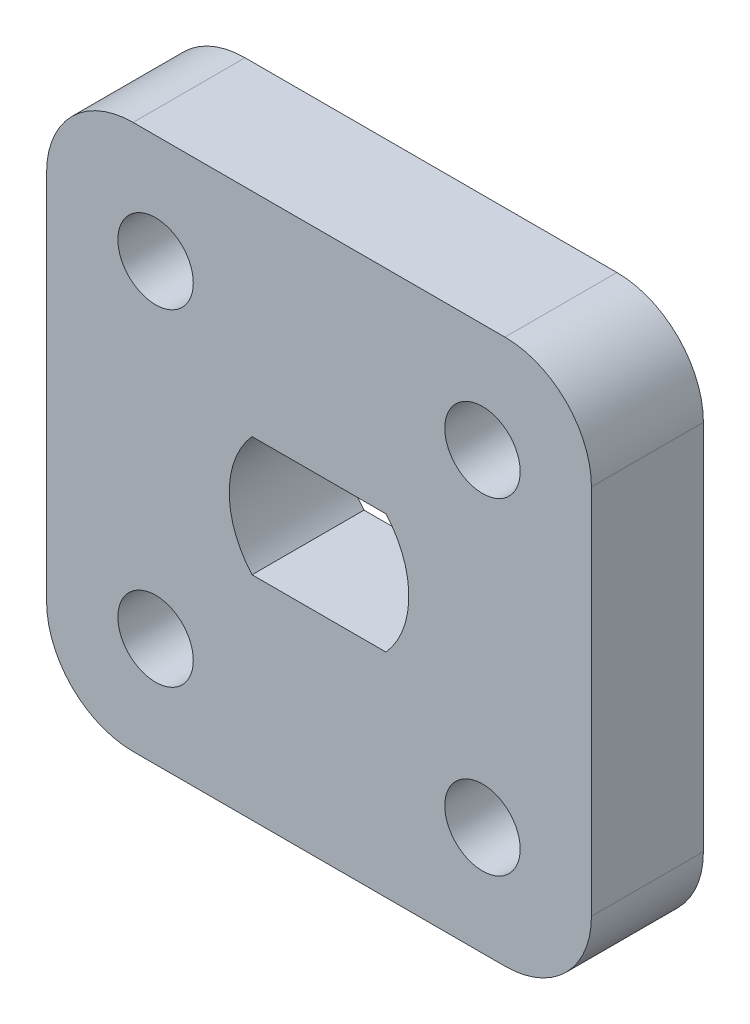
ISO-10303-21;
HEADER;
FILE_DESCRIPTION(('STEP AP214'),'2;1');
FILE_NAME('part.step','',(''),(''),'','','');
FILE_SCHEMA(('AUTOMOTIVE_DESIGN { 1 0 10303 214 1 1 1 1 }'));
ENDSEC;
DATA;
#1=APPLICATION_CONTEXT('core data for automotive mechanical design processes');
#2=APPLICATION_PROTOCOL_DEFINITION('international standard','automotive_design',2000,#1);
#3=PRODUCT_CONTEXT('',#1,'mechanical');
#4=PRODUCT('Part','Part','',(#3));
#5=PRODUCT_RELATED_PRODUCT_CATEGORY('part','',(#4));
#6=PRODUCT_DEFINITION_FORMATION('','',#4);
#7=PRODUCT_DEFINITION_CONTEXT('part definition',#1,'design');
#8=PRODUCT_DEFINITION('design','',#6,#7);
#9=PRODUCT_DEFINITION_SHAPE('','',#8);
#10=(LENGTH_UNIT() NAMED_UNIT(*) SI_UNIT(.MILLI.,.METRE.));
#11=(NAMED_UNIT(*) PLANE_ANGLE_UNIT() SI_UNIT($,.RADIAN.));
#12=(NAMED_UNIT(*) SI_UNIT($,.STERADIAN.) SOLID_ANGLE_UNIT());
#13=UNCERTAINTY_MEASURE_WITH_UNIT(LENGTH_MEASURE(1.E-05),#10,'distance_accuracy_value','');
#14=(GEOMETRIC_REPRESENTATION_CONTEXT(3) GLOBAL_UNCERTAINTY_ASSIGNED_CONTEXT((#13)) GLOBAL_UNIT_ASSIGNED_CONTEXT((#10,
#11,#12)) REPRESENTATION_CONTEXT('',''));
#15=CARTESIAN_POINT('',(0.,0.,0.));
#16=DIRECTION('',(0.,0.,1.));
#17=DIRECTION('',(1.,0.,0.));
#18=AXIS2_PLACEMENT_3D('',#15,#16,#17);
#19=CARTESIAN_POINT('',(0.,0.,4.11));
#20=DIRECTION('',(0.,0.,1.));
#21=DIRECTION('',(1.,0.,0.));
#22=AXIS2_PLACEMENT_3D('',#19,#20,#21);
#23=PLANE('',#22);
#24=CARTESIAN_POINT('',(0.,0.,4.11));
#25=DIRECTION('',(0.,0.,-1.));
#26=DIRECTION('',(-1.,0.,0.));
#27=AXIS2_PLACEMENT_3D('',#24,#25,#26);
#28=CIRCLE('',#27,3.2968);
#29=CARTESIAN_POINT('',(-2.45824327518657,-2.1968,4.11));
#30=VERTEX_POINT('',#29);
#31=CARTESIAN_POINT('',(-2.45824327518657,2.1968,4.11));
#32=VERTEX_POINT('',#31);
#33=EDGE_CURVE('E127',#30,#32,#28,.T.);
#34=ORIENTED_EDGE('',*,*,#33,.T.);
#35=DIRECTION('',(1.,0.,0.));
#36=VECTOR('',#35,1.);
#37=CARTESIAN_POINT('',(-2.45824327518657,2.1968,4.11));
#38=LINE('',#37,#36);
#39=CARTESIAN_POINT('',(2.45824327518657,2.1968,4.11));
#40=VERTEX_POINT('',#39);
#41=EDGE_CURVE('E139',#32,#40,#38,.T.);
#42=ORIENTED_EDGE('',*,*,#41,.T.);
#43=CARTESIAN_POINT('',(0.,0.,4.11));
#44=DIRECTION('',(0.,0.,-1.));
#45=DIRECTION('',(-1.,0.,0.));
#46=AXIS2_PLACEMENT_3D('',#43,#44,#45);
#47=CIRCLE('',#46,3.2968);
#48=CARTESIAN_POINT('',(2.45824327518657,-2.1968,4.11));
#49=VERTEX_POINT('',#48);
#50=EDGE_CURVE('E143',#40,#49,#47,.T.);
#51=ORIENTED_EDGE('',*,*,#50,.T.);
#52=DIRECTION('',(-1.,0.,0.));
#53=VECTOR('',#52,1.);
#54=CARTESIAN_POINT('',(-2.45824327518657,-2.1968,4.11));
#55=LINE('',#54,#53);
#56=EDGE_CURVE('E135',#49,#30,#55,.T.);
#57=ORIENTED_EDGE('',*,*,#56,.T.);
#58=EDGE_LOOP('',(#34,#42,#51,#57));
#59=FACE_BOUND('',#58,.T.);
#60=CARTESIAN_POINT('',(6.,-6.,4.11));
#61=DIRECTION('',(0.,0.,1.));
#62=DIRECTION('',(1.,0.,0.));
#63=AXIS2_PLACEMENT_3D('',#60,#61,#62);
#64=CIRCLE('',#63,1.3843);
#65=CARTESIAN_POINT('',(7.3843,-6.,4.11));
#66=VERTEX_POINT('',#65);
#67=EDGE_CURVE('E172',#66,#66,#64,.T.);
#68=ORIENTED_EDGE('',*,*,#67,.F.);
#69=EDGE_LOOP('',(#68));
#70=FACE_BOUND('',#69,.T.);
#71=CARTESIAN_POINT('',(-6.,5.99999999999999,4.11));
#72=DIRECTION('',(0.,0.,1.));
#73=DIRECTION('',(1.,0.,0.));
#74=AXIS2_PLACEMENT_3D('',#71,#72,#73);
#75=CIRCLE('',#74,1.3843);
#76=CARTESIAN_POINT('',(-4.61569999999999,5.99999999999999,4.11));
#77=VERTEX_POINT('',#76);
#78=EDGE_CURVE('E184',#77,#77,#75,.T.);
#79=ORIENTED_EDGE('',*,*,#78,.F.);
#80=EDGE_LOOP('',(#79));
#81=FACE_BOUND('',#80,.T.);
#82=DIRECTION('',(0.,-1.,0.));
#83=VECTOR('',#82,1.);
#84=CARTESIAN_POINT('',(-10.,-10.,4.11));
#85=LINE('',#84,#83);
#86=CARTESIAN_POINT('',(-10.,6.825,4.11));
#87=VERTEX_POINT('',#86);
#88=CARTESIAN_POINT('',(-10.,-6.825,4.11));
#89=VERTEX_POINT('',#88);
#90=EDGE_CURVE('E190',#87,#89,#85,.T.);
#91=ORIENTED_EDGE('',*,*,#90,.T.);
#92=CARTESIAN_POINT('',(-6.825,-6.825,4.11));
#93=DIRECTION('',(0.,0.,1.));
#94=DIRECTION('',(1.,0.,0.));
#95=AXIS2_PLACEMENT_3D('',#92,#93,#94);
#96=CIRCLE('',#95,3.175);
#97=CARTESIAN_POINT('',(-6.825,-10.,4.11));
#98=VERTEX_POINT('',#97);
#99=EDGE_CURVE('E233',#89,#98,#96,.T.);
#100=ORIENTED_EDGE('',*,*,#99,.T.);
#101=DIRECTION('',(1.,0.,0.));
#102=VECTOR('',#101,1.);
#103=CARTESIAN_POINT('',(10.,-10.,4.11));
#104=LINE('',#103,#102);
#105=CARTESIAN_POINT('',(6.825,-10.,4.11));
#106=VERTEX_POINT('',#105);
#107=EDGE_CURVE('E193',#98,#106,#104,.T.);
#108=ORIENTED_EDGE('',*,*,#107,.T.);
#109=CARTESIAN_POINT('',(6.825,-6.825,4.11));
#110=DIRECTION('',(0.,0.,1.));
#111=DIRECTION('',(1.,0.,0.));
#112=AXIS2_PLACEMENT_3D('',#109,#110,#111);
#113=CIRCLE('',#112,3.175);
#114=CARTESIAN_POINT('',(10.,-6.825,4.11));
#115=VERTEX_POINT('',#114);
#116=EDGE_CURVE('E231',#106,#115,#113,.T.);
#117=ORIENTED_EDGE('',*,*,#116,.T.);
#118=DIRECTION('',(0.,1.,0.));
#119=VECTOR('',#118,1.);
#120=CARTESIAN_POINT('',(10.,-10.,4.11));
#121=LINE('',#120,#119);
#122=CARTESIAN_POINT('',(10.,6.825,4.11));
#123=VERTEX_POINT('',#122);
#124=EDGE_CURVE('E197',#115,#123,#121,.T.);
#125=ORIENTED_EDGE('',*,*,#124,.T.);
#126=CARTESIAN_POINT('',(6.825,6.825,4.11));
#127=DIRECTION('',(0.,0.,1.));
#128=DIRECTION('',(1.,0.,0.));
#129=AXIS2_PLACEMENT_3D('',#126,#127,#128);
#130=CIRCLE('',#129,3.175);
#131=CARTESIAN_POINT('',(6.825,10.,4.11));
#132=VERTEX_POINT('',#131);
#133=EDGE_CURVE('E54',#123,#132,#130,.T.);
#134=ORIENTED_EDGE('',*,*,#133,.T.);
#135=DIRECTION('',(-1.,0.,0.));
#136=VECTOR('',#135,1.);
#137=CARTESIAN_POINT('',(10.,10.,4.11));
#138=LINE('',#137,#136);
#139=CARTESIAN_POINT('',(-6.825,10.,4.11));
#140=VERTEX_POINT('',#139);
#141=EDGE_CURVE('E199',#132,#140,#138,.T.);
#142=ORIENTED_EDGE('',*,*,#141,.T.);
#143=CARTESIAN_POINT('',(-6.825,6.825,4.11));
#144=DIRECTION('',(0.,0.,1.));
#145=DIRECTION('',(1.,0.,0.));
#146=AXIS2_PLACEMENT_3D('',#143,#144,#145);
#147=CIRCLE('',#146,3.175);
#148=EDGE_CURVE('E228',#140,#87,#147,.T.);
#149=ORIENTED_EDGE('',*,*,#148,.T.);
#150=EDGE_LOOP('',(#91,#100,#108,#117,#125,#134,#142,#149));
#151=FACE_BOUND('',#150,.T.);
#152=CARTESIAN_POINT('',(6.,5.99999999999999,4.11));
#153=DIRECTION('',(0.,0.,1.));
#154=DIRECTION('',(1.,0.,0.));
#155=AXIS2_PLACEMENT_3D('',#152,#153,#154);
#156=CIRCLE('',#155,1.3843);
#157=CARTESIAN_POINT('',(7.3843,5.99999999999999,4.11));
#158=VERTEX_POINT('',#157);
#159=EDGE_CURVE('E178',#158,#158,#156,.T.);
#160=ORIENTED_EDGE('',*,*,#159,.F.);
#161=EDGE_LOOP('',(#160));
#162=FACE_BOUND('',#161,.T.);
#163=CARTESIAN_POINT('',(-6.,-6.,4.11));
#164=DIRECTION('',(0.,0.,1.));
#165=DIRECTION('',(1.,0.,0.));
#166=AXIS2_PLACEMENT_3D('',#163,#164,#165);
#167=CIRCLE('',#166,1.3843);
#168=CARTESIAN_POINT('',(-4.61569999999999,-6.,4.11));
#169=VERTEX_POINT('',#168);
#170=EDGE_CURVE('E166',#169,#169,#167,.T.);
#171=ORIENTED_EDGE('',*,*,#170,.F.);
#172=EDGE_LOOP('',(#171));
#173=FACE_BOUND('',#172,.T.);
#174=ADVANCED_FACE('F33',(#59,#70,#81,#151,#162,#173),#23,.T.);
#175=CARTESIAN_POINT('',(0.,0.,0.));
#176=DIRECTION('',(0.,0.,1.));
#177=DIRECTION('',(1.,0.,0.));
#178=AXIS2_PLACEMENT_3D('',#175,#176,#177);
#179=PLANE('',#178);
#180=DIRECTION('',(1.,0.,0.));
#181=VECTOR('',#180,1.);
#182=CARTESIAN_POINT('',(-2.45824327518657,2.1968,0.));
#183=LINE('',#182,#181);
#184=CARTESIAN_POINT('',(-2.45824327518657,2.1968,0.));
#185=VERTEX_POINT('',#184);
#186=CARTESIAN_POINT('',(2.45824327518657,2.1968,0.));
#187=VERTEX_POINT('',#186);
#188=EDGE_CURVE('E156',#185,#187,#183,.T.);
#189=ORIENTED_EDGE('',*,*,#188,.F.);
#190=CARTESIAN_POINT('',(0.,0.,0.));
#191=DIRECTION('',(0.,0.,-1.));
#192=DIRECTION('',(-1.,0.,0.));
#193=AXIS2_PLACEMENT_3D('',#190,#191,#192);
#194=CIRCLE('',#193,3.2968);
#195=CARTESIAN_POINT('',(-2.45824327518657,-2.1968,0.));
#196=VERTEX_POINT('',#195);
#197=EDGE_CURVE('E130',#196,#185,#194,.T.);
#198=ORIENTED_EDGE('',*,*,#197,.F.);
#199=DIRECTION('',(-1.,0.,0.));
#200=VECTOR('',#199,1.);
#201=CARTESIAN_POINT('',(-2.45824327518657,-2.1968,0.));
#202=LINE('',#201,#200);
#203=CARTESIAN_POINT('',(2.45824327518657,-2.1968,0.));
#204=VERTEX_POINT('',#203);
#205=EDGE_CURVE('E147',#204,#196,#202,.T.);
#206=ORIENTED_EDGE('',*,*,#205,.F.);
#207=CARTESIAN_POINT('',(0.,0.,0.));
#208=DIRECTION('',(0.,0.,-1.));
#209=DIRECTION('',(-1.,0.,0.));
#210=AXIS2_PLACEMENT_3D('',#207,#208,#209);
#211=CIRCLE('',#210,3.2968);
#212=EDGE_CURVE('E150',#187,#204,#211,.T.);
#213=ORIENTED_EDGE('',*,*,#212,.F.);
#214=EDGE_LOOP('',(#189,#198,#206,#213));
#215=FACE_BOUND('',#214,.T.);
#216=DIRECTION('',(1.,0.,0.));
#217=VECTOR('',#216,1.);
#218=CARTESIAN_POINT('',(10.,-10.,0.));
#219=LINE('',#218,#217);
#220=CARTESIAN_POINT('',(-6.825,-10.,0.));
#221=VERTEX_POINT('',#220);
#222=CARTESIAN_POINT('',(6.825,-10.,0.));
#223=VERTEX_POINT('',#222);
#224=EDGE_CURVE('E204',#221,#223,#219,.T.);
#225=ORIENTED_EDGE('',*,*,#224,.F.);
#226=CARTESIAN_POINT('',(-6.825,-6.825,0.));
#227=DIRECTION('',(0.,0.,1.));
#228=DIRECTION('',(1.,0.,0.));
#229=AXIS2_PLACEMENT_3D('',#226,#227,#228);
#230=CIRCLE('',#229,3.175);
#231=CARTESIAN_POINT('',(-10.,-6.825,0.));
#232=VERTEX_POINT('',#231);
#233=EDGE_CURVE('E221',#221,#232,#230,.F.);
#234=ORIENTED_EDGE('',*,*,#233,.T.);
#235=DIRECTION('',(0.,-1.,0.));
#236=VECTOR('',#235,1.);
#237=CARTESIAN_POINT('',(-10.,-10.,0.));
#238=LINE('',#237,#236);
#239=CARTESIAN_POINT('',(-10.,6.825,0.));
#240=VERTEX_POINT('',#239);
#241=EDGE_CURVE('E187',#240,#232,#238,.T.);
#242=ORIENTED_EDGE('',*,*,#241,.F.);
#243=CARTESIAN_POINT('',(-6.825,6.825,0.));
#244=DIRECTION('',(0.,0.,1.));
#245=DIRECTION('',(1.,0.,0.));
#246=AXIS2_PLACEMENT_3D('',#243,#244,#245);
#247=CIRCLE('',#246,3.175);
#248=CARTESIAN_POINT('',(-6.825,10.,0.));
#249=VERTEX_POINT('',#248);
#250=EDGE_CURVE('E215',#240,#249,#247,.F.);
#251=ORIENTED_EDGE('',*,*,#250,.T.);
#252=DIRECTION('',(-1.,0.,0.));
#253=VECTOR('',#252,1.);
#254=CARTESIAN_POINT('',(10.,10.,0.));
#255=LINE('',#254,#253);
#256=CARTESIAN_POINT('',(6.825,10.,0.));
#257=VERTEX_POINT('',#256);
#258=EDGE_CURVE('E194',#257,#249,#255,.T.);
#259=ORIENTED_EDGE('',*,*,#258,.F.);
#260=CARTESIAN_POINT('',(6.825,6.825,0.));
#261=DIRECTION('',(0.,0.,1.));
#262=DIRECTION('',(1.,0.,0.));
#263=AXIS2_PLACEMENT_3D('',#260,#261,#262);
#264=CIRCLE('',#263,3.175);
#265=CARTESIAN_POINT('',(10.,6.825,0.));
#266=VERTEX_POINT('',#265);
#267=EDGE_CURVE('E217',#257,#266,#264,.F.);
#268=ORIENTED_EDGE('',*,*,#267,.T.);
#269=DIRECTION('',(0.,1.,0.));
#270=VECTOR('',#269,1.);
#271=CARTESIAN_POINT('',(10.,-10.,0.));
#272=LINE('',#271,#270);
#273=CARTESIAN_POINT('',(10.,-6.825,0.));
#274=VERTEX_POINT('',#273);
#275=EDGE_CURVE('E207',#274,#266,#272,.T.);
#276=ORIENTED_EDGE('',*,*,#275,.F.);
#277=CARTESIAN_POINT('',(6.825,-6.825,0.));
#278=DIRECTION('',(0.,0.,1.));
#279=DIRECTION('',(1.,0.,0.));
#280=AXIS2_PLACEMENT_3D('',#277,#278,#279);
#281=CIRCLE('',#280,3.175);
#282=EDGE_CURVE('E219',#274,#223,#281,.F.);
#283=ORIENTED_EDGE('',*,*,#282,.T.);
#284=EDGE_LOOP('',(#225,#234,#242,#251,#259,#268,#276,#283));
#285=FACE_BOUND('',#284,.T.);
#286=CARTESIAN_POINT('',(-6.,5.99999999999999,0.));
#287=DIRECTION('',(0.,0.,1.));
#288=DIRECTION('',(1.,0.,0.));
#289=AXIS2_PLACEMENT_3D('',#286,#287,#288);
#290=CIRCLE('',#289,1.3843);
#291=CARTESIAN_POINT('',(-4.61569999999999,5.99999999999999,0.));
#292=VERTEX_POINT('',#291);
#293=EDGE_CURVE('E181',#292,#292,#290,.T.);
#294=ORIENTED_EDGE('',*,*,#293,.T.);
#295=EDGE_LOOP('',(#294));
#296=FACE_BOUND('',#295,.T.);
#297=CARTESIAN_POINT('',(6.,5.99999999999999,0.));
#298=DIRECTION('',(0.,0.,1.));
#299=DIRECTION('',(1.,0.,0.));
#300=AXIS2_PLACEMENT_3D('',#297,#298,#299);
#301=CIRCLE('',#300,1.3843);
#302=CARTESIAN_POINT('',(7.3843,5.99999999999999,0.));
#303=VERTEX_POINT('',#302);
#304=EDGE_CURVE('E175',#303,#303,#301,.T.);
#305=ORIENTED_EDGE('',*,*,#304,.T.);
#306=EDGE_LOOP('',(#305));
#307=FACE_BOUND('',#306,.T.);
#308=CARTESIAN_POINT('',(6.,-6.,0.));
#309=DIRECTION('',(0.,0.,1.));
#310=DIRECTION('',(1.,0.,0.));
#311=AXIS2_PLACEMENT_3D('',#308,#309,#310);
#312=CIRCLE('',#311,1.3843);
#313=CARTESIAN_POINT('',(7.3843,-6.,0.));
#314=VERTEX_POINT('',#313);
#315=EDGE_CURVE('E169',#314,#314,#312,.T.);
#316=ORIENTED_EDGE('',*,*,#315,.T.);
#317=EDGE_LOOP('',(#316));
#318=FACE_BOUND('',#317,.T.);
#319=CARTESIAN_POINT('',(-6.,-6.,0.));
#320=DIRECTION('',(0.,0.,1.));
#321=DIRECTION('',(1.,0.,0.));
#322=AXIS2_PLACEMENT_3D('',#319,#320,#321);
#323=CIRCLE('',#322,1.3843);
#324=CARTESIAN_POINT('',(-4.61569999999999,-6.,0.));
#325=VERTEX_POINT('',#324);
#326=EDGE_CURVE('E162',#325,#325,#323,.T.);
#327=ORIENTED_EDGE('',*,*,#326,.T.);
#328=EDGE_LOOP('',(#327));
#329=FACE_BOUND('',#328,.T.);
#330=ADVANCED_FACE('F249',(#215,#285,#296,#307,#318,#329),#179,.F.);
#331=CARTESIAN_POINT('',(-10.,-10.,4.11));
#332=DIRECTION('',(1.,0.,0.));
#333=DIRECTION('',(0.,1.,0.));
#334=AXIS2_PLACEMENT_3D('',#331,#332,#333);
#335=PLANE('',#334);
#336=ORIENTED_EDGE('',*,*,#241,.T.);
#337=DIRECTION('',(0.,0.,-1.));
#338=VECTOR('',#337,1.);
#339=CARTESIAN_POINT('',(-10.,-6.825,4.11));
#340=LINE('',#339,#338);
#341=EDGE_CURVE('E226',#232,#89,#340,.F.);
#342=ORIENTED_EDGE('',*,*,#341,.T.);
#343=ORIENTED_EDGE('',*,*,#90,.F.);
#344=DIRECTION('',(0.,0.,-1.));
#345=VECTOR('',#344,1.);
#346=CARTESIAN_POINT('',(-10.,6.825,4.11));
#347=LINE('',#346,#345);
#348=EDGE_CURVE('E223',#87,#240,#347,.T.);
#349=ORIENTED_EDGE('',*,*,#348,.T.);
#350=EDGE_LOOP('',(#336,#342,#343,#349));
#351=FACE_BOUND('',#350,.T.);
#352=ADVANCED_FACE('F263',(#351),#335,.F.);
#353=CARTESIAN_POINT('',(10.,-10.,4.11));
#354=DIRECTION('',(0.,1.,0.));
#355=DIRECTION('',(-1.,0.,0.));
#356=AXIS2_PLACEMENT_3D('',#353,#354,#355);
#357=PLANE('',#356);
#358=ORIENTED_EDGE('',*,*,#107,.F.);
#359=DIRECTION('',(0.,0.,-1.));
#360=VECTOR('',#359,1.);
#361=CARTESIAN_POINT('',(-6.825,-10.,4.11));
#362=LINE('',#361,#360);
#363=EDGE_CURVE('E212',#98,#221,#362,.T.);
#364=ORIENTED_EDGE('',*,*,#363,.T.);
#365=ORIENTED_EDGE('',*,*,#224,.T.);
#366=DIRECTION('',(0.,0.,-1.));
#367=VECTOR('',#366,1.);
#368=CARTESIAN_POINT('',(6.825,-10.,4.11));
#369=LINE('',#368,#367);
#370=EDGE_CURVE('E201',#223,#106,#369,.F.);
#371=ORIENTED_EDGE('',*,*,#370,.T.);
#372=EDGE_LOOP('',(#358,#364,#365,#371));
#373=FACE_BOUND('',#372,.T.);
#374=ADVANCED_FACE('F271',(#373),#357,.F.);
#375=CARTESIAN_POINT('',(10.,-10.,4.11));
#376=DIRECTION('',(-1.,0.,0.));
#377=DIRECTION('',(0.,-1.,0.));
#378=AXIS2_PLACEMENT_3D('',#375,#376,#377);
#379=PLANE('',#378);
#380=ORIENTED_EDGE('',*,*,#124,.F.);
#381=DIRECTION('',(0.,0.,-1.));
#382=VECTOR('',#381,1.);
#383=CARTESIAN_POINT('',(10.,-6.825,4.11));
#384=LINE('',#383,#382);
#385=EDGE_CURVE('E237',#115,#274,#384,.T.);
#386=ORIENTED_EDGE('',*,*,#385,.T.);
#387=ORIENTED_EDGE('',*,*,#275,.T.);
#388=DIRECTION('',(0.,0.,-1.));
#389=VECTOR('',#388,1.);
#390=CARTESIAN_POINT('',(10.,6.825,4.11));
#391=LINE('',#390,#389);
#392=EDGE_CURVE('E235',#266,#123,#391,.F.);
#393=ORIENTED_EDGE('',*,*,#392,.T.);
#394=EDGE_LOOP('',(#380,#386,#387,#393));
#395=FACE_BOUND('',#394,.T.);
#396=ADVANCED_FACE('F243',(#395),#379,.F.);
#397=CARTESIAN_POINT('',(10.,10.,4.11));
#398=DIRECTION('',(0.,-1.,0.));
#399=DIRECTION('',(1.,0.,0.));
#400=AXIS2_PLACEMENT_3D('',#397,#398,#399);
#401=PLANE('',#400);
#402=ORIENTED_EDGE('',*,*,#141,.F.);
#403=DIRECTION('',(0.,0.,-1.));
#404=VECTOR('',#403,1.);
#405=CARTESIAN_POINT('',(6.825,10.,4.11));
#406=LINE('',#405,#404);
#407=EDGE_CURVE('E11',#132,#257,#406,.T.);
#408=ORIENTED_EDGE('',*,*,#407,.T.);
#409=ORIENTED_EDGE('',*,*,#258,.T.);
#410=DIRECTION('',(0.,0.,-1.));
#411=VECTOR('',#410,1.);
#412=CARTESIAN_POINT('',(-6.825,10.,4.11));
#413=LINE('',#412,#411);
#414=EDGE_CURVE('E41',#249,#140,#413,.F.);
#415=ORIENTED_EDGE('',*,*,#414,.T.);
#416=EDGE_LOOP('',(#402,#408,#409,#415));
#417=FACE_BOUND('',#416,.T.);
#418=ADVANCED_FACE('F255',(#417),#401,.F.);
#419=CARTESIAN_POINT('',(-6.,5.99999999999999,4.11));
#420=DIRECTION('',(0.,0.,-1.));
#421=DIRECTION('',(-1.,0.,0.));
#422=AXIS2_PLACEMENT_3D('',#419,#420,#421);
#423=CYLINDRICAL_SURFACE('',#422,1.3843);
#424=ORIENTED_EDGE('',*,*,#78,.T.);
#425=EDGE_LOOP('',(#424));
#426=FACE_BOUND('',#425,.T.);
#427=ORIENTED_EDGE('',*,*,#293,.F.);
#428=EDGE_LOOP('',(#427));
#429=FACE_BOUND('',#428,.T.);
#430=ADVANCED_FACE('F289',(#426,#429),#423,.F.);
#431=CARTESIAN_POINT('',(6.,5.99999999999999,4.11));
#432=DIRECTION('',(0.,0.,-1.));
#433=DIRECTION('',(-1.,0.,0.));
#434=AXIS2_PLACEMENT_3D('',#431,#432,#433);
#435=CYLINDRICAL_SURFACE('',#434,1.3843);
#436=ORIENTED_EDGE('',*,*,#159,.T.);
#437=EDGE_LOOP('',(#436));
#438=FACE_BOUND('',#437,.T.);
#439=ORIENTED_EDGE('',*,*,#304,.F.);
#440=EDGE_LOOP('',(#439));
#441=FACE_BOUND('',#440,.T.);
#442=ADVANCED_FACE('F322',(#438,#441),#435,.F.);
#443=CARTESIAN_POINT('',(6.,-6.,4.11));
#444=DIRECTION('',(0.,0.,-1.));
#445=DIRECTION('',(-1.,0.,0.));
#446=AXIS2_PLACEMENT_3D('',#443,#444,#445);
#447=CYLINDRICAL_SURFACE('',#446,1.3843);
#448=ORIENTED_EDGE('',*,*,#67,.T.);
#449=EDGE_LOOP('',(#448));
#450=FACE_BOUND('',#449,.T.);
#451=ORIENTED_EDGE('',*,*,#315,.F.);
#452=EDGE_LOOP('',(#451));
#453=FACE_BOUND('',#452,.T.);
#454=ADVANCED_FACE('F329',(#450,#453),#447,.F.);
#455=CARTESIAN_POINT('',(-6.,-6.,4.11));
#456=DIRECTION('',(0.,0.,-1.));
#457=DIRECTION('',(-1.,0.,0.));
#458=AXIS2_PLACEMENT_3D('',#455,#456,#457);
#459=CYLINDRICAL_SURFACE('',#458,1.3843);
#460=ORIENTED_EDGE('',*,*,#170,.T.);
#461=EDGE_LOOP('',(#460));
#462=FACE_BOUND('',#461,.T.);
#463=ORIENTED_EDGE('',*,*,#326,.F.);
#464=EDGE_LOOP('',(#463));
#465=FACE_BOUND('',#464,.T.);
#466=ADVANCED_FACE('F336',(#462,#465),#459,.F.);
#467=CARTESIAN_POINT('',(0.,0.,4.11));
#468=DIRECTION('',(0.,0.,-1.));
#469=DIRECTION('',(-1.,0.,0.));
#470=AXIS2_PLACEMENT_3D('',#467,#468,#469);
#471=CYLINDRICAL_SURFACE('',#470,3.2968);
#472=ORIENTED_EDGE('',*,*,#197,.T.);
#473=DIRECTION('',(0.,0.,-1.));
#474=VECTOR('',#473,1.);
#475=CARTESIAN_POINT('',(-2.45824327518657,2.1968,4.11));
#476=LINE('',#475,#474);
#477=EDGE_CURVE('E123',#32,#185,#476,.T.);
#478=ORIENTED_EDGE('',*,*,#477,.F.);
#479=ORIENTED_EDGE('',*,*,#33,.F.);
#480=DIRECTION('',(0.,0.,-1.));
#481=VECTOR('',#480,1.);
#482=CARTESIAN_POINT('',(-2.45824327518657,-2.1968,4.11));
#483=LINE('',#482,#481);
#484=EDGE_CURVE('E160',#30,#196,#483,.T.);
#485=ORIENTED_EDGE('',*,*,#484,.T.);
#486=EDGE_LOOP('',(#472,#478,#479,#485));
#487=FACE_BOUND('',#486,.T.);
#488=ADVANCED_FACE('F125',(#487),#471,.F.);
#489=CARTESIAN_POINT('',(-2.45824327518657,-2.1968,4.11));
#490=DIRECTION('',(0.,-1.,0.));
#491=DIRECTION('',(1.,0.,0.));
#492=AXIS2_PLACEMENT_3D('',#489,#490,#491);
#493=PLANE('',#492);
#494=ORIENTED_EDGE('',*,*,#205,.T.);
#495=ORIENTED_EDGE('',*,*,#484,.F.);
#496=ORIENTED_EDGE('',*,*,#56,.F.);
#497=DIRECTION('',(0.,0.,-1.));
#498=VECTOR('',#497,1.);
#499=CARTESIAN_POINT('',(2.45824327518657,-2.1968,4.11));
#500=LINE('',#499,#498);
#501=EDGE_CURVE('E163',#49,#204,#500,.T.);
#502=ORIENTED_EDGE('',*,*,#501,.T.);
#503=EDGE_LOOP('',(#494,#495,#496,#502));
#504=FACE_BOUND('',#503,.T.);
#505=ADVANCED_FACE('F351',(#504),#493,.F.);
#506=CARTESIAN_POINT('',(0.,0.,4.11));
#507=DIRECTION('',(0.,0.,-1.));
#508=DIRECTION('',(-1.,0.,0.));
#509=AXIS2_PLACEMENT_3D('',#506,#507,#508);
#510=CYLINDRICAL_SURFACE('',#509,3.2968);
#511=ORIENTED_EDGE('',*,*,#212,.T.);
#512=ORIENTED_EDGE('',*,*,#501,.F.);
#513=ORIENTED_EDGE('',*,*,#50,.F.);
#514=DIRECTION('',(0.,0.,-1.));
#515=VECTOR('',#514,1.);
#516=CARTESIAN_POINT('',(2.45824327518657,2.1968,4.11));
#517=LINE('',#516,#515);
#518=EDGE_CURVE('E134',#40,#187,#517,.T.);
#519=ORIENTED_EDGE('',*,*,#518,.T.);
#520=EDGE_LOOP('',(#511,#512,#513,#519));
#521=FACE_BOUND('',#520,.T.);
#522=ADVANCED_FACE('F358',(#521),#510,.F.);
#523=CARTESIAN_POINT('',(-2.45824327518657,2.1968,4.11));
#524=DIRECTION('',(0.,1.,0.));
#525=DIRECTION('',(-1.,0.,0.));
#526=AXIS2_PLACEMENT_3D('',#523,#524,#525);
#527=PLANE('',#526);
#528=ORIENTED_EDGE('',*,*,#188,.T.);
#529=ORIENTED_EDGE('',*,*,#518,.F.);
#530=ORIENTED_EDGE('',*,*,#41,.F.);
#531=ORIENTED_EDGE('',*,*,#477,.T.);
#532=EDGE_LOOP('',(#528,#529,#530,#531));
#533=FACE_BOUND('',#532,.T.);
#534=ADVANCED_FACE('F140',(#533),#527,.F.);
#535=CARTESIAN_POINT('',(-6.825,-6.825,4.11));
#536=DIRECTION('',(0.,0.,-1.));
#537=DIRECTION('',(-1.,0.,0.));
#538=AXIS2_PLACEMENT_3D('',#535,#536,#537);
#539=CYLINDRICAL_SURFACE('',#538,3.175);
#540=ORIENTED_EDGE('',*,*,#99,.F.);
#541=ORIENTED_EDGE('',*,*,#341,.F.);
#542=ORIENTED_EDGE('',*,*,#233,.F.);
#543=ORIENTED_EDGE('',*,*,#363,.F.);
#544=EDGE_LOOP('',(#540,#541,#542,#543));
#545=FACE_BOUND('',#544,.T.);
#546=ADVANCED_FACE('F268',(#545),#539,.T.);
#547=CARTESIAN_POINT('',(6.825,-6.825,4.11));
#548=DIRECTION('',(0.,0.,-1.));
#549=DIRECTION('',(-1.,0.,0.));
#550=AXIS2_PLACEMENT_3D('',#547,#548,#549);
#551=CYLINDRICAL_SURFACE('',#550,3.175);
#552=ORIENTED_EDGE('',*,*,#116,.F.);
#553=ORIENTED_EDGE('',*,*,#370,.F.);
#554=ORIENTED_EDGE('',*,*,#282,.F.);
#555=ORIENTED_EDGE('',*,*,#385,.F.);
#556=EDGE_LOOP('',(#552,#553,#554,#555));
#557=FACE_BOUND('',#556,.T.);
#558=ADVANCED_FACE('F273',(#557),#551,.T.);
#559=CARTESIAN_POINT('',(6.825,6.825,4.11));
#560=DIRECTION('',(0.,0.,-1.));
#561=DIRECTION('',(-1.,0.,0.));
#562=AXIS2_PLACEMENT_3D('',#559,#560,#561);
#563=CYLINDRICAL_SURFACE('',#562,3.175);
#564=ORIENTED_EDGE('',*,*,#133,.F.);
#565=ORIENTED_EDGE('',*,*,#392,.F.);
#566=ORIENTED_EDGE('',*,*,#267,.F.);
#567=ORIENTED_EDGE('',*,*,#407,.F.);
#568=EDGE_LOOP('',(#564,#565,#566,#567));
#569=FACE_BOUND('',#568,.T.);
#570=ADVANCED_FACE('F254',(#569),#563,.T.);
#571=CARTESIAN_POINT('',(-6.825,6.825,4.11));
#572=DIRECTION('',(0.,0.,-1.));
#573=DIRECTION('',(-1.,0.,0.));
#574=AXIS2_PLACEMENT_3D('',#571,#572,#573);
#575=CYLINDRICAL_SURFACE('',#574,3.175);
#576=ORIENTED_EDGE('',*,*,#148,.F.);
#577=ORIENTED_EDGE('',*,*,#414,.F.);
#578=ORIENTED_EDGE('',*,*,#250,.F.);
#579=ORIENTED_EDGE('',*,*,#348,.F.);
#580=EDGE_LOOP('',(#576,#577,#578,#579));
#581=FACE_BOUND('',#580,.T.);
#582=ADVANCED_FACE('F35',(#581),#575,.T.);
#583=CLOSED_SHELL('',(#174,#330,#352,#374,#396,#418,#430,#442,#454,#466,#488,#505,#522,#534,
#546,#558,#570,#582));
#584=MANIFOLD_SOLID_BREP('B2',#583);
#585=ADVANCED_BREP_SHAPE_REPRESENTATION('',(#18,#584),#14);
#586=SHAPE_DEFINITION_REPRESENTATION(#9,#585);
ENDSEC;
END-ISO-10303-21;
